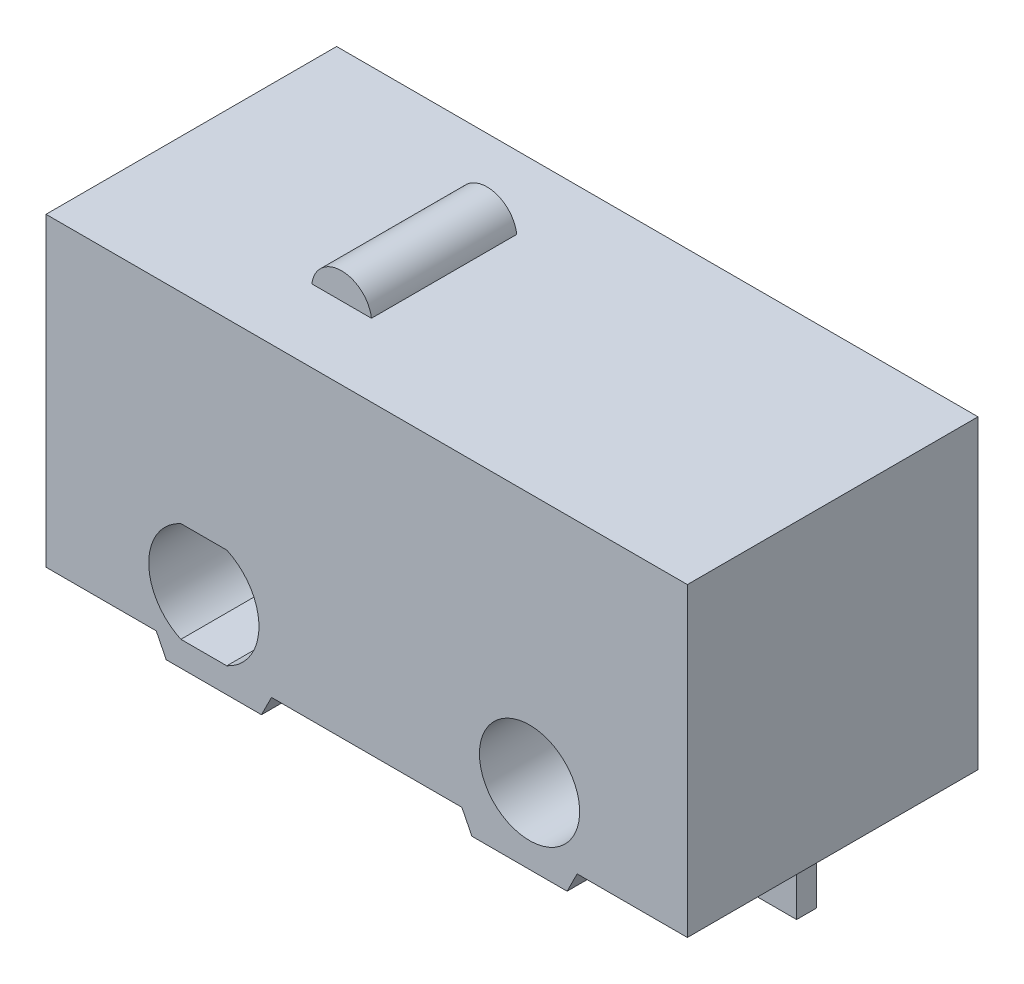
ISO-10303-21;
HEADER;
FILE_DESCRIPTION(('STEP AP214'),'2;1');
FILE_NAME('part.step','',(''),(''),'','','');
FILE_SCHEMA(('AUTOMOTIVE_DESIGN { 1 0 10303 214 1 1 1 1 }'));
ENDSEC;
DATA;
#1=APPLICATION_CONTEXT('core data for automotive mechanical design processes');
#2=APPLICATION_PROTOCOL_DEFINITION('international standard','automotive_design',2000,#1);
#3=PRODUCT_CONTEXT('',#1,'mechanical');
#4=PRODUCT('Part','Part','',(#3));
#5=PRODUCT_RELATED_PRODUCT_CATEGORY('part','',(#4));
#6=PRODUCT_DEFINITION_FORMATION('','',#4);
#7=PRODUCT_DEFINITION_CONTEXT('part definition',#1,'design');
#8=PRODUCT_DEFINITION('design','',#6,#7);
#9=PRODUCT_DEFINITION_SHAPE('','',#8);
#10=(LENGTH_UNIT() NAMED_UNIT(*) SI_UNIT(.MILLI.,.METRE.));
#11=(NAMED_UNIT(*) PLANE_ANGLE_UNIT() SI_UNIT($,.RADIAN.));
#12=(NAMED_UNIT(*) SI_UNIT($,.STERADIAN.) SOLID_ANGLE_UNIT());
#13=UNCERTAINTY_MEASURE_WITH_UNIT(LENGTH_MEASURE(1.E-05),#10,'distance_accuracy_value','');
#14=(GEOMETRIC_REPRESENTATION_CONTEXT(3) GLOBAL_UNCERTAINTY_ASSIGNED_CONTEXT((#13)) GLOBAL_UNIT_ASSIGNED_CONTEXT((#10,
#11,#12)) REPRESENTATION_CONTEXT('',''));
#15=CARTESIAN_POINT('',(0.,0.,0.));
#16=DIRECTION('',(0.,0.,1.));
#17=DIRECTION('',(1.,0.,0.));
#18=AXIS2_PLACEMENT_3D('',#15,#16,#17);
#19=CARTESIAN_POINT('',(-9.65,-1.5,2.9));
#20=DIRECTION('',(0.,1.,0.));
#21=DIRECTION('',(-1.,0.,0.));
#22=AXIS2_PLACEMENT_3D('',#19,#20,#21);
#23=PLANE('',#22);
#24=DIRECTION('',(1.,0.,0.));
#25=VECTOR('',#24,1.);
#26=CARTESIAN_POINT('',(-9.65,-1.5,-2.9));
#27=LINE('',#26,#25);
#28=CARTESIAN_POINT('',(-1.15,-1.5,-2.9));
#29=VERTEX_POINT('',#28);
#30=CARTESIAN_POINT('',(0.75,-1.5,-2.9));
#31=VERTEX_POINT('',#30);
#32=EDGE_CURVE('E440',#29,#31,#27,.T.);
#33=ORIENTED_EDGE('',*,*,#32,.T.);
#34=DIRECTION('',(0.,0.,1.));
#35=VECTOR('',#34,1.);
#36=CARTESIAN_POINT('',(0.75,-1.5,-2.9));
#37=LINE('',#36,#35);
#38=CARTESIAN_POINT('',(0.75,-1.5,2.90000000006785));
#39=VERTEX_POINT('',#38);
#40=EDGE_CURVE('E335',#31,#39,#37,.T.);
#41=ORIENTED_EDGE('',*,*,#40,.T.);
#42=DIRECTION('',(1.,0.,0.));
#43=VECTOR('',#42,1.);
#44=CARTESIAN_POINT('',(-9.65,-1.5,2.9));
#45=LINE('',#44,#43);
#46=CARTESIAN_POINT('',(-1.15,-1.5,2.90000000006785));
#47=VERTEX_POINT('',#46);
#48=EDGE_CURVE('E450',#47,#39,#45,.T.);
#49=ORIENTED_EDGE('',*,*,#48,.F.);
#50=DIRECTION('',(0.,0.,1.));
#51=VECTOR('',#50,1.);
#52=CARTESIAN_POINT('',(-1.15,-1.5,-2.9));
#53=LINE('',#52,#51);
#54=EDGE_CURVE('E375',#29,#47,#53,.T.);
#55=ORIENTED_EDGE('',*,*,#54,.F.);
#56=EDGE_LOOP('',(#33,#41,#49,#55));
#57=FACE_BOUND('',#56,.T.);
#58=ADVANCED_FACE('F16',(#57),#23,.F.);
#59=CARTESIAN_POINT('',(-9.65,5.,2.9));
#60=DIRECTION('',(0.,-1.,0.));
#61=DIRECTION('',(0.,0.,-1.));
#62=AXIS2_PLACEMENT_3D('',#59,#60,#61);
#63=PLANE('',#62);
#64=DIRECTION('',(-1.,0.,0.));
#65=VECTOR('',#64,1.);
#66=CARTESIAN_POINT('',(-9.65,5.,-2.9));
#67=LINE('',#66,#65);
#68=CARTESIAN_POINT('',(3.15,5.,-2.9));
#69=VERTEX_POINT('',#68);
#70=CARTESIAN_POINT('',(-9.65,5.,-2.9));
#71=VERTEX_POINT('',#70);
#72=EDGE_CURVE('E445',#69,#71,#67,.T.);
#73=ORIENTED_EDGE('',*,*,#72,.T.);
#74=DIRECTION('',(0.,0.,-1.));
#75=VECTOR('',#74,1.);
#76=CARTESIAN_POINT('',(-9.65,5.,2.9));
#77=LINE('',#76,#75);
#78=CARTESIAN_POINT('',(-9.65,5.,2.9));
#79=VERTEX_POINT('',#78);
#80=EDGE_CURVE('E25',#79,#71,#77,.T.);
#81=ORIENTED_EDGE('',*,*,#80,.F.);
#82=DIRECTION('',(-1.,0.,0.));
#83=VECTOR('',#82,1.);
#84=CARTESIAN_POINT('',(-9.65,5.,2.9));
#85=LINE('',#84,#83);
#86=CARTESIAN_POINT('',(3.15,5.,2.9));
#87=VERTEX_POINT('',#86);
#88=EDGE_CURVE('E455',#87,#79,#85,.T.);
#89=ORIENTED_EDGE('',*,*,#88,.F.);
#90=DIRECTION('',(0.,0.,-1.));
#91=VECTOR('',#90,1.);
#92=CARTESIAN_POINT('',(3.15,5.,2.9));
#93=LINE('',#92,#91);
#94=EDGE_CURVE('E11',#87,#69,#93,.T.);
#95=ORIENTED_EDGE('',*,*,#94,.T.);
#96=EDGE_LOOP('',(#73,#81,#89,#95));
#97=FACE_BOUND('',#96,.T.);
#98=DIRECTION('',(1.,0.,0.));
#99=VECTOR('',#98,1.);
#100=CARTESIAN_POINT('',(-5.79516451722003,5.,1.45));
#101=LINE('',#100,#99);
#102=CARTESIAN_POINT('',(-5.79516451722003,5.,1.45));
#103=VERTEX_POINT('',#102);
#104=CARTESIAN_POINT('',(-4.60483548277998,5.,1.45));
#105=VERTEX_POINT('',#104);
#106=EDGE_CURVE('E391',#103,#105,#101,.T.);
#107=ORIENTED_EDGE('',*,*,#106,.F.);
#108=DIRECTION('',(0.,0.,-1.));
#109=VECTOR('',#108,1.);
#110=CARTESIAN_POINT('',(-5.79516451722003,5.,1.45));
#111=LINE('',#110,#109);
#112=CARTESIAN_POINT('',(-5.79516451722003,5.,-1.45));
#113=VERTEX_POINT('',#112);
#114=EDGE_CURVE('E396',#103,#113,#111,.T.);
#115=ORIENTED_EDGE('',*,*,#114,.T.);
#116=DIRECTION('',(1.,0.,0.));
#117=VECTOR('',#116,1.);
#118=CARTESIAN_POINT('',(-5.79516451722003,5.,-1.45));
#119=LINE('',#118,#117);
#120=CARTESIAN_POINT('',(-4.60483548277998,5.,-1.45));
#121=VERTEX_POINT('',#120);
#122=EDGE_CURVE('E386',#113,#121,#119,.T.);
#123=ORIENTED_EDGE('',*,*,#122,.T.);
#124=DIRECTION('',(0.,0.,-1.));
#125=VECTOR('',#124,1.);
#126=CARTESIAN_POINT('',(-4.60483548277998,5.,1.45));
#127=LINE('',#126,#125);
#128=EDGE_CURVE('E393',#105,#121,#127,.T.);
#129=ORIENTED_EDGE('',*,*,#128,.F.);
#130=EDGE_LOOP('',(#107,#115,#123,#129));
#131=FACE_BOUND('',#130,.T.);
#132=ADVANCED_FACE('F519',(#97,#131),#63,.F.);
#133=CARTESIAN_POINT('',(-9.65,5.,2.9));
#134=DIRECTION('',(1.,0.,0.));
#135=DIRECTION('',(0.,0.,-1.));
#136=AXIS2_PLACEMENT_3D('',#133,#134,#135);
#137=PLANE('',#136);
#138=DIRECTION('',(0.,-1.,0.));
#139=VECTOR('',#138,1.);
#140=CARTESIAN_POINT('',(-9.65,5.,-2.9));
#141=LINE('',#140,#139);
#142=CARTESIAN_POINT('',(-9.65,-1.1,-2.9));
#143=VERTEX_POINT('',#142);
#144=EDGE_CURVE('E437',#71,#143,#141,.T.);
#145=ORIENTED_EDGE('',*,*,#144,.T.);
#146=DIRECTION('',(0.,0.,1.));
#147=VECTOR('',#146,1.);
#148=CARTESIAN_POINT('',(-9.65,-1.1,-2.9));
#149=LINE('',#148,#147);
#150=CARTESIAN_POINT('',(-9.65,-1.1,2.90000000006785));
#151=VERTEX_POINT('',#150);
#152=EDGE_CURVE('E350',#143,#151,#149,.T.);
#153=ORIENTED_EDGE('',*,*,#152,.T.);
#154=DIRECTION('',(0.,-1.,0.));
#155=VECTOR('',#154,1.);
#156=CARTESIAN_POINT('',(-9.65,5.,2.9));
#157=LINE('',#156,#155);
#158=EDGE_CURVE('E447',#79,#151,#157,.T.);
#159=ORIENTED_EDGE('',*,*,#158,.F.);
#160=ORIENTED_EDGE('',*,*,#80,.T.);
#161=EDGE_LOOP('',(#145,#153,#159,#160));
#162=FACE_BOUND('',#161,.T.);
#163=ADVANCED_FACE('F18',(#162),#137,.F.);
#164=CARTESIAN_POINT('',(-7.25,-1.5,2.90000000006785));
#165=VERTEX_POINT('',#164);
#166=CARTESIAN_POINT('',(-5.35,-1.5,2.90000000006785));
#167=VERTEX_POINT('',#166);
#168=EDGE_CURVE('E451',#165,#167,#45,.T.);
#169=ORIENTED_EDGE('',*,*,#168,.F.);
#170=DIRECTION('',(0.,0.,1.));
#171=VECTOR('',#170,1.);
#172=CARTESIAN_POINT('',(-7.25,-1.5,-2.9));
#173=LINE('',#172,#171);
#174=CARTESIAN_POINT('',(-7.25,-1.5,-2.9));
#175=VERTEX_POINT('',#174);
#176=EDGE_CURVE('E349',#175,#165,#173,.T.);
#177=ORIENTED_EDGE('',*,*,#176,.F.);
#178=CARTESIAN_POINT('',(-5.35,-1.5,-2.9));
#179=VERTEX_POINT('',#178);
#180=EDGE_CURVE('E441',#175,#179,#27,.T.);
#181=ORIENTED_EDGE('',*,*,#180,.T.);
#182=DIRECTION('',(0.,0.,1.));
#183=VECTOR('',#182,1.);
#184=CARTESIAN_POINT('',(-5.35,-1.5,-2.9));
#185=LINE('',#184,#183);
#186=EDGE_CURVE('E378',#179,#167,#185,.T.);
#187=ORIENTED_EDGE('',*,*,#186,.T.);
#188=EDGE_LOOP('',(#169,#177,#181,#187));
#189=FACE_BOUND('',#188,.T.);
#190=ADVANCED_FACE('F532',(#189),#23,.F.);
#191=CARTESIAN_POINT('',(3.15,5.,2.9));
#192=DIRECTION('',(-1.,0.,0.));
#193=DIRECTION('',(0.,0.,1.));
#194=AXIS2_PLACEMENT_3D('',#191,#192,#193);
#195=PLANE('',#194);
#196=DIRECTION('',(0.,1.,0.));
#197=VECTOR('',#196,1.);
#198=CARTESIAN_POINT('',(3.15,5.,2.9));
#199=LINE('',#198,#197);
#200=CARTESIAN_POINT('',(3.15,-1.1,2.90000000006785));
#201=VERTEX_POINT('',#200);
#202=EDGE_CURVE('E453',#201,#87,#199,.T.);
#203=ORIENTED_EDGE('',*,*,#202,.F.);
#204=DIRECTION('',(0.,0.,1.));
#205=VECTOR('',#204,1.);
#206=CARTESIAN_POINT('',(3.15,-1.1,-2.9));
#207=LINE('',#206,#205);
#208=CARTESIAN_POINT('',(3.15,-1.1,-2.9));
#209=VERTEX_POINT('',#208);
#210=EDGE_CURVE('E332',#209,#201,#207,.T.);
#211=ORIENTED_EDGE('',*,*,#210,.F.);
#212=DIRECTION('',(0.,1.,0.));
#213=VECTOR('',#212,1.);
#214=CARTESIAN_POINT('',(3.15,5.,-2.9));
#215=LINE('',#214,#213);
#216=EDGE_CURVE('E443',#209,#69,#215,.T.);
#217=ORIENTED_EDGE('',*,*,#216,.T.);
#218=ORIENTED_EDGE('',*,*,#94,.F.);
#219=EDGE_LOOP('',(#203,#211,#217,#218));
#220=FACE_BOUND('',#219,.T.);
#221=ADVANCED_FACE('F512',(#220),#195,.F.);
#222=CARTESIAN_POINT('',(-9.65,5.,2.9));
#223=DIRECTION('',(0.,0.,1.));
#224=DIRECTION('',(1.,0.,0.));
#225=AXIS2_PLACEMENT_3D('',#222,#223,#224);
#226=PLANE('',#225);
#227=DIRECTION('',(-1.,0.,0.));
#228=VECTOR('',#227,1.);
#229=CARTESIAN_POINT('',(0.95,-1.1,2.90000000006785));
#230=LINE('',#229,#228);
#231=CARTESIAN_POINT('',(0.95,-1.1,2.90000000006785));
#232=VERTEX_POINT('',#231);
#233=EDGE_CURVE('E320',#201,#232,#230,.T.);
#234=ORIENTED_EDGE('',*,*,#233,.F.);
#235=ORIENTED_EDGE('',*,*,#202,.T.);
#236=ORIENTED_EDGE('',*,*,#88,.T.);
#237=ORIENTED_EDGE('',*,*,#158,.T.);
#238=DIRECTION('',(-1.,0.,0.));
#239=VECTOR('',#238,1.);
#240=CARTESIAN_POINT('',(-9.65,-1.1,2.90000000006785));
#241=LINE('',#240,#239);
#242=CARTESIAN_POINT('',(-7.45,-1.1,2.90000000006785));
#243=VERTEX_POINT('',#242);
#244=EDGE_CURVE('E341',#243,#151,#241,.T.);
#245=ORIENTED_EDGE('',*,*,#244,.F.);
#246=DIRECTION('',(-0.44721359549996,0.894427190999915,0.));
#247=VECTOR('',#246,1.);
#248=CARTESIAN_POINT('',(-7.45,-1.1,2.90000000006785));
#249=LINE('',#248,#247);
#250=EDGE_CURVE('E334',#165,#243,#249,.T.);
#251=ORIENTED_EDGE('',*,*,#250,.F.);
#252=ORIENTED_EDGE('',*,*,#168,.T.);
#253=DIRECTION('',(-0.447213595499955,-0.894427190999917,0.));
#254=VECTOR('',#253,1.);
#255=CARTESIAN_POINT('',(-5.35,-1.5,2.90000000006785));
#256=LINE('',#255,#254);
#257=CARTESIAN_POINT('',(-5.15,-1.1,2.90000000006785));
#258=VERTEX_POINT('',#257);
#259=EDGE_CURVE('E362',#258,#167,#256,.T.);
#260=ORIENTED_EDGE('',*,*,#259,.F.);
#261=DIRECTION('',(-1.,0.,0.));
#262=VECTOR('',#261,1.);
#263=CARTESIAN_POINT('',(-5.15,-1.1,2.90000000006785));
#264=LINE('',#263,#262);
#265=CARTESIAN_POINT('',(-1.35,-1.1,2.90000000006785));
#266=VERTEX_POINT('',#265);
#267=EDGE_CURVE('E359',#266,#258,#264,.T.);
#268=ORIENTED_EDGE('',*,*,#267,.F.);
#269=DIRECTION('',(-0.447213595499956,0.894427190999917,0.));
#270=VECTOR('',#269,1.);
#271=CARTESIAN_POINT('',(-1.35,-1.1,2.90000000006785));
#272=LINE('',#271,#270);
#273=EDGE_CURVE('E353',#47,#266,#272,.T.);
#274=ORIENTED_EDGE('',*,*,#273,.F.);
#275=ORIENTED_EDGE('',*,*,#48,.T.);
#276=DIRECTION('',(-0.447213595499956,-0.894427190999917,0.));
#277=VECTOR('',#276,1.);
#278=CARTESIAN_POINT('',(0.95,-1.1,2.90000000006785));
#279=LINE('',#278,#277);
#280=EDGE_CURVE('E323',#232,#39,#279,.T.);
#281=ORIENTED_EDGE('',*,*,#280,.F.);
#282=EDGE_LOOP('',(#234,#235,#236,#237,#245,#251,#252,#260,#268,#274,#275,#281));
#283=FACE_BOUND('',#282,.T.);
#284=CARTESIAN_POINT('',(-6.5,0.,2.9));
#285=DIRECTION('',(0.,0.,-1.));
#286=DIRECTION('',(-1.,0.,0.));
#287=AXIS2_PLACEMENT_3D('',#284,#285,#286);
#288=CIRCLE('',#287,1.1);
#289=CARTESIAN_POINT('',(-6.04174243050442,1.,2.9));
#290=VERTEX_POINT('',#289);
#291=CARTESIAN_POINT('',(-6.04174243050442,-1.,2.9));
#292=VERTEX_POINT('',#291);
#293=EDGE_CURVE('E410',#290,#292,#288,.T.);
#294=ORIENTED_EDGE('',*,*,#293,.T.);
#295=DIRECTION('',(-1.,0.,0.));
#296=VECTOR('',#295,1.);
#297=CARTESIAN_POINT('',(-6.04174243050442,-1.,2.9));
#298=LINE('',#297,#296);
#299=CARTESIAN_POINT('',(-6.95825756949558,-1.,2.9));
#300=VERTEX_POINT('',#299);
#301=EDGE_CURVE('E413',#292,#300,#298,.T.);
#302=ORIENTED_EDGE('',*,*,#301,.T.);
#303=CARTESIAN_POINT('',(-6.5,0.,2.9));
#304=DIRECTION('',(0.,0.,-1.));
#305=DIRECTION('',(-1.,0.,0.));
#306=AXIS2_PLACEMENT_3D('',#303,#304,#305);
#307=CIRCLE('',#306,1.1);
#308=CARTESIAN_POINT('',(-6.95825756949558,1.,2.9));
#309=VERTEX_POINT('',#308);
#310=EDGE_CURVE('E416',#300,#309,#307,.T.);
#311=ORIENTED_EDGE('',*,*,#310,.T.);
#312=DIRECTION('',(1.,0.,0.));
#313=VECTOR('',#312,1.);
#314=CARTESIAN_POINT('',(-6.04174243050442,1.,2.9));
#315=LINE('',#314,#313);
#316=EDGE_CURVE('E419',#309,#290,#315,.T.);
#317=ORIENTED_EDGE('',*,*,#316,.T.);
#318=EDGE_LOOP('',(#294,#302,#311,#317));
#319=FACE_BOUND('',#318,.T.);
#320=CARTESIAN_POINT('',(0.,0.,2.9));
#321=DIRECTION('',(0.,0.,-1.));
#322=DIRECTION('',(-1.,0.,0.));
#323=AXIS2_PLACEMENT_3D('',#320,#321,#322);
#324=CIRCLE('',#323,1.);
#325=CARTESIAN_POINT('',(-1.,0.,2.9));
#326=VERTEX_POINT('',#325);
#327=EDGE_CURVE('E434',#326,#326,#324,.T.);
#328=ORIENTED_EDGE('',*,*,#327,.T.);
#329=EDGE_LOOP('',(#328));
#330=FACE_BOUND('',#329,.T.);
#331=ADVANCED_FACE('F497',(#283,#319,#330),#226,.T.);
#332=CARTESIAN_POINT('',(-9.65,5.,-2.9));
#333=DIRECTION('',(0.,0.,1.));
#334=DIRECTION('',(1.,0.,0.));
#335=AXIS2_PLACEMENT_3D('',#332,#333,#334);
#336=PLANE('',#335);
#337=ORIENTED_EDGE('',*,*,#216,.F.);
#338=DIRECTION('',(-1.,0.,0.));
#339=VECTOR('',#338,1.);
#340=CARTESIAN_POINT('',(0.95,-1.1,-2.9));
#341=LINE('',#340,#339);
#342=CARTESIAN_POINT('',(0.95,-1.1,-2.9));
#343=VERTEX_POINT('',#342);
#344=EDGE_CURVE('E325',#209,#343,#341,.T.);
#345=ORIENTED_EDGE('',*,*,#344,.T.);
#346=DIRECTION('',(-0.447213595499956,-0.894427190999917,0.));
#347=VECTOR('',#346,1.);
#348=CARTESIAN_POINT('',(0.95,-1.1,-2.9));
#349=LINE('',#348,#347);
#350=EDGE_CURVE('E328',#343,#31,#349,.T.);
#351=ORIENTED_EDGE('',*,*,#350,.T.);
#352=ORIENTED_EDGE('',*,*,#32,.F.);
#353=DIRECTION('',(-0.447213595499956,0.894427190999917,0.));
#354=VECTOR('',#353,1.);
#355=CARTESIAN_POINT('',(-1.35,-1.1,-2.9));
#356=LINE('',#355,#354);
#357=CARTESIAN_POINT('',(-1.35,-1.1,-2.9));
#358=VERTEX_POINT('',#357);
#359=EDGE_CURVE('E365',#29,#358,#356,.T.);
#360=ORIENTED_EDGE('',*,*,#359,.T.);
#361=DIRECTION('',(-1.,0.,0.));
#362=VECTOR('',#361,1.);
#363=CARTESIAN_POINT('',(-5.15,-1.1,-2.9));
#364=LINE('',#363,#362);
#365=CARTESIAN_POINT('',(-5.15,-1.1,-2.9));
#366=VERTEX_POINT('',#365);
#367=EDGE_CURVE('E368',#358,#366,#364,.T.);
#368=ORIENTED_EDGE('',*,*,#367,.T.);
#369=DIRECTION('',(-0.447213595499955,-0.894427190999917,0.));
#370=VECTOR('',#369,1.);
#371=CARTESIAN_POINT('',(-5.35,-1.5,-2.9));
#372=LINE('',#371,#370);
#373=EDGE_CURVE('E371',#366,#179,#372,.T.);
#374=ORIENTED_EDGE('',*,*,#373,.T.);
#375=ORIENTED_EDGE('',*,*,#180,.F.);
#376=DIRECTION('',(-0.44721359549996,0.894427190999915,0.));
#377=VECTOR('',#376,1.);
#378=CARTESIAN_POINT('',(-7.45,-1.1,-2.9));
#379=LINE('',#378,#377);
#380=CARTESIAN_POINT('',(-7.45,-1.1,-2.9));
#381=VERTEX_POINT('',#380);
#382=EDGE_CURVE('E343',#175,#381,#379,.T.);
#383=ORIENTED_EDGE('',*,*,#382,.T.);
#384=DIRECTION('',(-1.,0.,0.));
#385=VECTOR('',#384,1.);
#386=CARTESIAN_POINT('',(-9.65,-1.1,-2.9));
#387=LINE('',#386,#385);
#388=EDGE_CURVE('E346',#381,#143,#387,.T.);
#389=ORIENTED_EDGE('',*,*,#388,.T.);
#390=ORIENTED_EDGE('',*,*,#144,.F.);
#391=ORIENTED_EDGE('',*,*,#72,.F.);
#392=EDGE_LOOP('',(#337,#345,#351,#352,#360,#368,#374,#375,#383,#389,#390,#391));
#393=FACE_BOUND('',#392,.T.);
#394=DIRECTION('',(-1.,0.,0.));
#395=VECTOR('',#394,1.);
#396=CARTESIAN_POINT('',(-6.04174243050442,-1.,-2.9));
#397=LINE('',#396,#395);
#398=CARTESIAN_POINT('',(-6.04174243050442,-1.,-2.9));
#399=VERTEX_POINT('',#398);
#400=CARTESIAN_POINT('',(-6.95825756949558,-1.,-2.9));
#401=VERTEX_POINT('',#400);
#402=EDGE_CURVE('E401',#399,#401,#397,.T.);
#403=ORIENTED_EDGE('',*,*,#402,.F.);
#404=CARTESIAN_POINT('',(-6.5,0.,-2.9));
#405=DIRECTION('',(0.,0.,-1.));
#406=DIRECTION('',(-1.,0.,0.));
#407=AXIS2_PLACEMENT_3D('',#404,#405,#406);
#408=CIRCLE('',#407,1.1);
#409=CARTESIAN_POINT('',(-6.04174243050442,1.,-2.9));
#410=VERTEX_POINT('',#409);
#411=EDGE_CURVE('E399',#410,#399,#408,.T.);
#412=ORIENTED_EDGE('',*,*,#411,.F.);
#413=DIRECTION('',(1.,0.,0.));
#414=VECTOR('',#413,1.);
#415=CARTESIAN_POINT('',(-6.04174243050442,1.,-2.9));
#416=LINE('',#415,#414);
#417=CARTESIAN_POINT('',(-6.95825756949558,1.,-2.9));
#418=VERTEX_POINT('',#417);
#419=EDGE_CURVE('E407',#418,#410,#416,.T.);
#420=ORIENTED_EDGE('',*,*,#419,.F.);
#421=CARTESIAN_POINT('',(-6.5,0.,-2.9));
#422=DIRECTION('',(0.,0.,-1.));
#423=DIRECTION('',(-1.,0.,0.));
#424=AXIS2_PLACEMENT_3D('',#421,#422,#423);
#425=CIRCLE('',#424,1.1);
#426=EDGE_CURVE('E404',#401,#418,#425,.T.);
#427=ORIENTED_EDGE('',*,*,#426,.F.);
#428=EDGE_LOOP('',(#403,#412,#420,#427));
#429=FACE_BOUND('',#428,.T.);
#430=CARTESIAN_POINT('',(0.,0.,-2.9));
#431=DIRECTION('',(0.,0.,-1.));
#432=DIRECTION('',(-1.,0.,0.));
#433=AXIS2_PLACEMENT_3D('',#430,#431,#432);
#434=CIRCLE('',#433,1.);
#435=CARTESIAN_POINT('',(-1.,0.,-2.9));
#436=VERTEX_POINT('',#435);
#437=EDGE_CURVE('E425',#436,#436,#434,.T.);
#438=ORIENTED_EDGE('',*,*,#437,.F.);
#439=EDGE_LOOP('',(#438));
#440=FACE_BOUND('',#439,.T.);
#441=ADVANCED_FACE('F508',(#393,#429,#440),#336,.F.);
#442=CARTESIAN_POINT('',(0.,0.,2.9));
#443=DIRECTION('',(0.,0.,-1.));
#444=DIRECTION('',(-1.,0.,0.));
#445=AXIS2_PLACEMENT_3D('',#442,#443,#444);
#446=CYLINDRICAL_SURFACE('',#445,1.);
#447=ORIENTED_EDGE('',*,*,#327,.F.);
#448=EDGE_LOOP('',(#447));
#449=FACE_BOUND('',#448,.T.);
#450=ORIENTED_EDGE('',*,*,#437,.T.);
#451=EDGE_LOOP('',(#450));
#452=FACE_BOUND('',#451,.T.);
#453=ADVANCED_FACE('F900',(#449,#452),#446,.F.);
#454=CARTESIAN_POINT('',(-6.5,0.,2.9));
#455=DIRECTION('',(0.,0.,-1.));
#456=DIRECTION('',(-1.,0.,0.));
#457=AXIS2_PLACEMENT_3D('',#454,#455,#456);
#458=CYLINDRICAL_SURFACE('',#457,1.1);
#459=ORIENTED_EDGE('',*,*,#411,.T.);
#460=DIRECTION('',(0.,0.,-1.));
#461=VECTOR('',#460,1.);
#462=CARTESIAN_POINT('',(-6.04174243050442,-1.,2.9));
#463=LINE('',#462,#461);
#464=EDGE_CURVE('E422',#292,#399,#463,.T.);
#465=ORIENTED_EDGE('',*,*,#464,.F.);
#466=ORIENTED_EDGE('',*,*,#293,.F.);
#467=DIRECTION('',(0.,0.,-1.));
#468=VECTOR('',#467,1.);
#469=CARTESIAN_POINT('',(-6.04174243050442,1.,2.9));
#470=LINE('',#469,#468);
#471=EDGE_CURVE('E423',#290,#410,#470,.T.);
#472=ORIENTED_EDGE('',*,*,#471,.T.);
#473=EDGE_LOOP('',(#459,#465,#466,#472));
#474=FACE_BOUND('',#473,.T.);
#475=ADVANCED_FACE('F889',(#474),#458,.F.);
#476=CARTESIAN_POINT('',(-6.04174243050442,1.,2.9));
#477=DIRECTION('',(0.,1.,0.));
#478=DIRECTION('',(0.,0.,1.));
#479=AXIS2_PLACEMENT_3D('',#476,#477,#478);
#480=PLANE('',#479);
#481=ORIENTED_EDGE('',*,*,#419,.T.);
#482=ORIENTED_EDGE('',*,*,#471,.F.);
#483=ORIENTED_EDGE('',*,*,#316,.F.);
#484=DIRECTION('',(0.,0.,-1.));
#485=VECTOR('',#484,1.);
#486=CARTESIAN_POINT('',(-6.95825756949558,1.,2.9));
#487=LINE('',#486,#485);
#488=EDGE_CURVE('E426',#309,#418,#487,.T.);
#489=ORIENTED_EDGE('',*,*,#488,.T.);
#490=EDGE_LOOP('',(#481,#482,#483,#489));
#491=FACE_BOUND('',#490,.T.);
#492=ADVANCED_FACE('F878',(#491),#480,.F.);
#493=CARTESIAN_POINT('',(-6.5,0.,2.9));
#494=DIRECTION('',(0.,0.,-1.));
#495=DIRECTION('',(-1.,0.,0.));
#496=AXIS2_PLACEMENT_3D('',#493,#494,#495);
#497=CYLINDRICAL_SURFACE('',#496,1.1);
#498=ORIENTED_EDGE('',*,*,#426,.T.);
#499=ORIENTED_EDGE('',*,*,#488,.F.);
#500=ORIENTED_EDGE('',*,*,#310,.F.);
#501=DIRECTION('',(0.,0.,-1.));
#502=VECTOR('',#501,1.);
#503=CARTESIAN_POINT('',(-6.95825756949558,-1.,2.9));
#504=LINE('',#503,#502);
#505=EDGE_CURVE('E428',#300,#401,#504,.T.);
#506=ORIENTED_EDGE('',*,*,#505,.T.);
#507=EDGE_LOOP('',(#498,#499,#500,#506));
#508=FACE_BOUND('',#507,.T.);
#509=ADVANCED_FACE('F867',(#508),#497,.F.);
#510=CARTESIAN_POINT('',(-6.04174243050442,-1.,2.9));
#511=DIRECTION('',(0.,-1.,0.));
#512=DIRECTION('',(1.,0.,0.));
#513=AXIS2_PLACEMENT_3D('',#510,#511,#512);
#514=PLANE('',#513);
#515=ORIENTED_EDGE('',*,*,#402,.T.);
#516=ORIENTED_EDGE('',*,*,#505,.F.);
#517=ORIENTED_EDGE('',*,*,#301,.F.);
#518=ORIENTED_EDGE('',*,*,#464,.T.);
#519=EDGE_LOOP('',(#515,#516,#517,#518));
#520=FACE_BOUND('',#519,.T.);
#521=ADVANCED_FACE('F857',(#520),#514,.F.);
#522=CARTESIAN_POINT('',(-5.2,4.9239789671061,1.45));
#523=DIRECTION('',(0.,0.,-1.));
#524=DIRECTION('',(-1.,0.,0.));
#525=AXIS2_PLACEMENT_3D('',#522,#523,#524);
#526=CYLINDRICAL_SURFACE('',#525,0.6);
#527=CARTESIAN_POINT('',(-5.2,4.9239789671061,-1.45));
#528=DIRECTION('',(0.,0.,1.));
#529=DIRECTION('',(-1.,0.,0.));
#530=AXIS2_PLACEMENT_3D('',#527,#528,#529);
#531=CIRCLE('',#530,0.6);
#532=EDGE_CURVE('E377',#121,#113,#531,.T.);
#533=ORIENTED_EDGE('',*,*,#532,.T.);
#534=ORIENTED_EDGE('',*,*,#114,.F.);
#535=CARTESIAN_POINT('',(-5.2,4.9239789671061,1.45));
#536=DIRECTION('',(0.,0.,1.));
#537=DIRECTION('',(-1.,0.,0.));
#538=AXIS2_PLACEMENT_3D('',#535,#536,#537);
#539=CIRCLE('',#538,0.6);
#540=EDGE_CURVE('E389',#105,#103,#539,.T.);
#541=ORIENTED_EDGE('',*,*,#540,.F.);
#542=ORIENTED_EDGE('',*,*,#128,.T.);
#543=EDGE_LOOP('',(#533,#534,#541,#542));
#544=FACE_BOUND('',#543,.T.);
#545=ADVANCED_FACE('F847',(#544),#526,.T.);
#546=CARTESIAN_POINT('',(-5.2,4.9239789671061,1.45));
#547=DIRECTION('',(0.,0.,-1.));
#548=DIRECTION('',(-1.,0.,0.));
#549=AXIS2_PLACEMENT_3D('',#546,#547,#548);
#550=PLANE('',#549);
#551=ORIENTED_EDGE('',*,*,#540,.T.);
#552=ORIENTED_EDGE('',*,*,#106,.T.);
#553=EDGE_LOOP('',(#551,#552));
#554=FACE_BOUND('',#553,.T.);
#555=ADVANCED_FACE('F553',(#554),#550,.F.);
#556=CARTESIAN_POINT('',(-5.2,4.9239789671061,-1.45));
#557=DIRECTION('',(0.,0.,-1.));
#558=DIRECTION('',(-1.,0.,0.));
#559=AXIS2_PLACEMENT_3D('',#556,#557,#558);
#560=PLANE('',#559);
#561=ORIENTED_EDGE('',*,*,#532,.F.);
#562=ORIENTED_EDGE('',*,*,#122,.F.);
#563=EDGE_LOOP('',(#561,#562));
#564=FACE_BOUND('',#563,.T.);
#565=ADVANCED_FACE('F545',(#564),#560,.T.);
#566=CARTESIAN_POINT('',(-1.35,-1.1,-2.9));
#567=DIRECTION('',(0.894427190999917,0.447213595499956,0.));
#568=DIRECTION('',(-0.447213595499956,0.894427190999917,0.));
#569=AXIS2_PLACEMENT_3D('',#566,#567,#568);
#570=PLANE('',#569);
#571=ORIENTED_EDGE('',*,*,#273,.T.);
#572=DIRECTION('',(0.,0.,1.));
#573=VECTOR('',#572,1.);
#574=CARTESIAN_POINT('',(-1.35,-1.1,-2.9));
#575=LINE('',#574,#573);
#576=EDGE_CURVE('E374',#358,#266,#575,.T.);
#577=ORIENTED_EDGE('',*,*,#576,.F.);
#578=ORIENTED_EDGE('',*,*,#359,.F.);
#579=ORIENTED_EDGE('',*,*,#54,.T.);
#580=EDGE_LOOP('',(#571,#577,#578,#579));
#581=FACE_BOUND('',#580,.T.);
#582=ADVANCED_FACE('F543',(#581),#570,.F.);
#583=CARTESIAN_POINT('',(-5.35,-1.5,-2.9));
#584=DIRECTION('',(-0.894427190999917,0.447213595499955,0.));
#585=DIRECTION('',(-0.447213595499955,-0.894427190999917,0.));
#586=AXIS2_PLACEMENT_3D('',#583,#584,#585);
#587=PLANE('',#586);
#588=ORIENTED_EDGE('',*,*,#259,.T.);
#589=ORIENTED_EDGE('',*,*,#186,.F.);
#590=ORIENTED_EDGE('',*,*,#373,.F.);
#591=DIRECTION('',(0.,0.,1.));
#592=VECTOR('',#591,1.);
#593=CARTESIAN_POINT('',(-5.15,-1.1,-2.9));
#594=LINE('',#593,#592);
#595=EDGE_CURVE('E381',#366,#258,#594,.T.);
#596=ORIENTED_EDGE('',*,*,#595,.T.);
#597=EDGE_LOOP('',(#588,#589,#590,#596));
#598=FACE_BOUND('',#597,.T.);
#599=ADVANCED_FACE('F537',(#598),#587,.F.);
#600=CARTESIAN_POINT('',(-5.15,-1.1,-2.9));
#601=DIRECTION('',(0.,1.,0.));
#602=DIRECTION('',(-1.,0.,0.));
#603=AXIS2_PLACEMENT_3D('',#600,#601,#602);
#604=PLANE('',#603);
#605=DIRECTION('',(0.,0.,-1.));
#606=VECTOR('',#605,1.);
#607=CARTESIAN_POINT('',(-4.05,-1.1,0.2));
#608=LINE('',#607,#606);
#609=CARTESIAN_POINT('',(-4.05,-1.1,0.2));
#610=VERTEX_POINT('',#609);
#611=CARTESIAN_POINT('',(-4.05,-1.1,-0.2));
#612=VERTEX_POINT('',#611);
#613=EDGE_CURVE('E277',#610,#612,#608,.T.);
#614=ORIENTED_EDGE('',*,*,#613,.F.);
#615=DIRECTION('',(-1.,0.,0.));
#616=VECTOR('',#615,1.);
#617=CARTESIAN_POINT('',(-4.05,-1.1,0.2));
#618=LINE('',#617,#616);
#619=CARTESIAN_POINT('',(-2.45,-1.1,0.2));
#620=VERTEX_POINT('',#619);
#621=EDGE_CURVE('E274',#620,#610,#618,.T.);
#622=ORIENTED_EDGE('',*,*,#621,.F.);
#623=DIRECTION('',(0.,0.,-1.));
#624=VECTOR('',#623,1.);
#625=CARTESIAN_POINT('',(-2.45,-1.1,0.2));
#626=LINE('',#625,#624);
#627=CARTESIAN_POINT('',(-2.45,-1.1,-0.2));
#628=VERTEX_POINT('',#627);
#629=EDGE_CURVE('E280',#620,#628,#626,.T.);
#630=ORIENTED_EDGE('',*,*,#629,.T.);
#631=DIRECTION('',(-1.,0.,0.));
#632=VECTOR('',#631,1.);
#633=CARTESIAN_POINT('',(-4.05,-1.1,-0.2));
#634=LINE('',#633,#632);
#635=EDGE_CURVE('E264',#628,#612,#634,.T.);
#636=ORIENTED_EDGE('',*,*,#635,.T.);
#637=EDGE_LOOP('',(#614,#622,#630,#636));
#638=FACE_BOUND('',#637,.T.);
#639=ORIENTED_EDGE('',*,*,#267,.T.);
#640=ORIENTED_EDGE('',*,*,#595,.F.);
#641=ORIENTED_EDGE('',*,*,#367,.F.);
#642=ORIENTED_EDGE('',*,*,#576,.T.);
#643=EDGE_LOOP('',(#639,#640,#641,#642));
#644=FACE_BOUND('',#643,.T.);
#645=ADVANCED_FACE('F541',(#638,#644),#604,.F.);
#646=CARTESIAN_POINT('',(-9.65,-1.1,-2.9));
#647=DIRECTION('',(0.,1.,0.));
#648=DIRECTION('',(0.,0.,1.));
#649=AXIS2_PLACEMENT_3D('',#646,#647,#648);
#650=PLANE('',#649);
#651=DIRECTION('',(0.,0.,-1.));
#652=VECTOR('',#651,1.);
#653=CARTESIAN_POINT('',(-9.13,-1.1,0.2));
#654=LINE('',#653,#652);
#655=CARTESIAN_POINT('',(-9.13,-1.1,0.2));
#656=VERTEX_POINT('',#655);
#657=CARTESIAN_POINT('',(-9.13,-1.1,-0.2));
#658=VERTEX_POINT('',#657);
#659=EDGE_CURVE('E309',#656,#658,#654,.T.);
#660=ORIENTED_EDGE('',*,*,#659,.F.);
#661=DIRECTION('',(-1.,0.,0.));
#662=VECTOR('',#661,1.);
#663=CARTESIAN_POINT('',(-9.13,-1.1,0.2));
#664=LINE('',#663,#662);
#665=CARTESIAN_POINT('',(-7.53,-1.1,0.2));
#666=VERTEX_POINT('',#665);
#667=EDGE_CURVE('E306',#666,#656,#664,.T.);
#668=ORIENTED_EDGE('',*,*,#667,.F.);
#669=DIRECTION('',(0.,0.,-1.));
#670=VECTOR('',#669,1.);
#671=CARTESIAN_POINT('',(-7.53,-1.1,0.2));
#672=LINE('',#671,#670);
#673=CARTESIAN_POINT('',(-7.53,-1.1,-0.2));
#674=VERTEX_POINT('',#673);
#675=EDGE_CURVE('E312',#666,#674,#672,.T.);
#676=ORIENTED_EDGE('',*,*,#675,.T.);
#677=DIRECTION('',(-1.,0.,0.));
#678=VECTOR('',#677,1.);
#679=CARTESIAN_POINT('',(-9.13,-1.1,-0.2));
#680=LINE('',#679,#678);
#681=EDGE_CURVE('E296',#674,#658,#680,.T.);
#682=ORIENTED_EDGE('',*,*,#681,.T.);
#683=EDGE_LOOP('',(#660,#668,#676,#682));
#684=FACE_BOUND('',#683,.T.);
#685=ORIENTED_EDGE('',*,*,#244,.T.);
#686=ORIENTED_EDGE('',*,*,#152,.F.);
#687=ORIENTED_EDGE('',*,*,#388,.F.);
#688=DIRECTION('',(0.,0.,1.));
#689=VECTOR('',#688,1.);
#690=CARTESIAN_POINT('',(-7.45,-1.1,-2.9));
#691=LINE('',#690,#689);
#692=EDGE_CURVE('E354',#381,#243,#691,.T.);
#693=ORIENTED_EDGE('',*,*,#692,.T.);
#694=EDGE_LOOP('',(#685,#686,#687,#693));
#695=FACE_BOUND('',#694,.T.);
#696=ADVANCED_FACE('F524',(#684,#695),#650,.F.);
#697=CARTESIAN_POINT('',(-7.45,-1.1,-2.9));
#698=DIRECTION('',(0.894427190999915,0.44721359549996,0.));
#699=DIRECTION('',(-0.44721359549996,0.894427190999915,0.));
#700=AXIS2_PLACEMENT_3D('',#697,#698,#699);
#701=PLANE('',#700);
#702=ORIENTED_EDGE('',*,*,#250,.T.);
#703=ORIENTED_EDGE('',*,*,#692,.F.);
#704=ORIENTED_EDGE('',*,*,#382,.F.);
#705=ORIENTED_EDGE('',*,*,#176,.T.);
#706=EDGE_LOOP('',(#702,#703,#704,#705));
#707=FACE_BOUND('',#706,.T.);
#708=ADVANCED_FACE('F488',(#707),#701,.F.);
#709=CARTESIAN_POINT('',(0.95,-1.1,-2.9));
#710=DIRECTION('',(0.,1.,0.));
#711=DIRECTION('',(-1.,0.,0.));
#712=AXIS2_PLACEMENT_3D('',#709,#710,#711);
#713=PLANE('',#712);
#714=DIRECTION('',(0.,0.,-1.));
#715=VECTOR('',#714,1.);
#716=CARTESIAN_POINT('',(1.03,-1.1,0.2));
#717=LINE('',#716,#715);
#718=CARTESIAN_POINT('',(1.03,-1.1,0.2));
#719=VERTEX_POINT('',#718);
#720=CARTESIAN_POINT('',(1.03,-1.1,-0.2));
#721=VERTEX_POINT('',#720);
#722=EDGE_CURVE('E33',#719,#721,#717,.T.);
#723=ORIENTED_EDGE('',*,*,#722,.F.);
#724=DIRECTION('',(-1.,0.,0.));
#725=VECTOR('',#724,1.);
#726=CARTESIAN_POINT('',(1.03,-1.1,0.2));
#727=LINE('',#726,#725);
#728=CARTESIAN_POINT('',(2.63,-1.1,0.2));
#729=VERTEX_POINT('',#728);
#730=EDGE_CURVE('E37',#729,#719,#727,.T.);
#731=ORIENTED_EDGE('',*,*,#730,.F.);
#732=DIRECTION('',(0.,0.,-1.));
#733=VECTOR('',#732,1.);
#734=CARTESIAN_POINT('',(2.63,-1.1,0.2));
#735=LINE('',#734,#733);
#736=CARTESIAN_POINT('',(2.63,-1.1,-0.2));
#737=VERTEX_POINT('',#736);
#738=EDGE_CURVE('E254',#729,#737,#735,.T.);
#739=ORIENTED_EDGE('',*,*,#738,.T.);
#740=DIRECTION('',(-1.,0.,0.));
#741=VECTOR('',#740,1.);
#742=CARTESIAN_POINT('',(1.03,-1.1,-0.2));
#743=LINE('',#742,#741);
#744=EDGE_CURVE('E245',#737,#721,#743,.T.);
#745=ORIENTED_EDGE('',*,*,#744,.T.);
#746=EDGE_LOOP('',(#723,#731,#739,#745));
#747=FACE_BOUND('',#746,.T.);
#748=ORIENTED_EDGE('',*,*,#233,.T.);
#749=DIRECTION('',(0.,0.,1.));
#750=VECTOR('',#749,1.);
#751=CARTESIAN_POINT('',(0.95,-1.1,-2.9));
#752=LINE('',#751,#750);
#753=EDGE_CURVE('E331',#343,#232,#752,.T.);
#754=ORIENTED_EDGE('',*,*,#753,.F.);
#755=ORIENTED_EDGE('',*,*,#344,.F.);
#756=ORIENTED_EDGE('',*,*,#210,.T.);
#757=EDGE_LOOP('',(#748,#754,#755,#756));
#758=FACE_BOUND('',#757,.T.);
#759=ADVANCED_FACE('F484',(#747,#758),#713,.F.);
#760=CARTESIAN_POINT('',(0.95,-1.1,-2.9));
#761=DIRECTION('',(-0.894427190999917,0.447213595499956,0.));
#762=DIRECTION('',(-0.447213595499956,-0.894427190999917,0.));
#763=AXIS2_PLACEMENT_3D('',#760,#761,#762);
#764=PLANE('',#763);
#765=ORIENTED_EDGE('',*,*,#280,.T.);
#766=ORIENTED_EDGE('',*,*,#40,.F.);
#767=ORIENTED_EDGE('',*,*,#350,.F.);
#768=ORIENTED_EDGE('',*,*,#753,.T.);
#769=EDGE_LOOP('',(#765,#766,#767,#768));
#770=FACE_BOUND('',#769,.T.);
#771=ADVANCED_FACE('F487',(#770),#764,.F.);
#772=CARTESIAN_POINT('',(-9.13,-1.1,0.2));
#773=DIRECTION('',(1.,0.,0.));
#774=DIRECTION('',(0.,0.,-1.));
#775=AXIS2_PLACEMENT_3D('',#772,#773,#774);
#776=PLANE('',#775);
#777=DIRECTION('',(0.,-1.,0.));
#778=VECTOR('',#777,1.);
#779=CARTESIAN_POINT('',(-9.13,-1.1,-0.2));
#780=LINE('',#779,#778);
#781=CARTESIAN_POINT('',(-9.13,-2.4,-0.2));
#782=VERTEX_POINT('',#781);
#783=EDGE_CURVE('E288',#658,#782,#780,.T.);
#784=ORIENTED_EDGE('',*,*,#783,.T.);
#785=DIRECTION('',(0.,0.,-1.));
#786=VECTOR('',#785,1.);
#787=CARTESIAN_POINT('',(-9.13,-2.4,0.2));
#788=LINE('',#787,#786);
#789=CARTESIAN_POINT('',(-9.13,-2.4,0.2));
#790=VERTEX_POINT('',#789);
#791=EDGE_CURVE('E317',#790,#782,#788,.T.);
#792=ORIENTED_EDGE('',*,*,#791,.F.);
#793=DIRECTION('',(0.,-1.,0.));
#794=VECTOR('',#793,1.);
#795=CARTESIAN_POINT('',(-9.13,-1.1,0.2));
#796=LINE('',#795,#794);
#797=EDGE_CURVE('E298',#656,#790,#796,.T.);
#798=ORIENTED_EDGE('',*,*,#797,.F.);
#799=ORIENTED_EDGE('',*,*,#659,.T.);
#800=EDGE_LOOP('',(#784,#792,#798,#799));
#801=FACE_BOUND('',#800,.T.);
#802=ADVANCED_FACE('F717',(#801),#776,.F.);
#803=CARTESIAN_POINT('',(-9.13,-2.4,0.2));
#804=DIRECTION('',(0.,1.,0.));
#805=DIRECTION('',(0.,0.,1.));
#806=AXIS2_PLACEMENT_3D('',#803,#804,#805);
#807=PLANE('',#806);
#808=DIRECTION('',(1.,0.,0.));
#809=VECTOR('',#808,1.);
#810=CARTESIAN_POINT('',(-9.13,-2.4,-0.2));
#811=LINE('',#810,#809);
#812=CARTESIAN_POINT('',(-7.53,-2.4,-0.2));
#813=VERTEX_POINT('',#812);
#814=EDGE_CURVE('E291',#782,#813,#811,.T.);
#815=ORIENTED_EDGE('',*,*,#814,.T.);
#816=DIRECTION('',(0.,0.,-1.));
#817=VECTOR('',#816,1.);
#818=CARTESIAN_POINT('',(-7.53,-2.4,0.2));
#819=LINE('',#818,#817);
#820=CARTESIAN_POINT('',(-7.53,-2.4,0.2));
#821=VERTEX_POINT('',#820);
#822=EDGE_CURVE('E314',#821,#813,#819,.T.);
#823=ORIENTED_EDGE('',*,*,#822,.F.);
#824=DIRECTION('',(1.,0.,0.));
#825=VECTOR('',#824,1.);
#826=CARTESIAN_POINT('',(-9.13,-2.4,0.2));
#827=LINE('',#826,#825);
#828=EDGE_CURVE('E301',#790,#821,#827,.T.);
#829=ORIENTED_EDGE('',*,*,#828,.F.);
#830=ORIENTED_EDGE('',*,*,#791,.T.);
#831=EDGE_LOOP('',(#815,#823,#829,#830));
#832=FACE_BOUND('',#831,.T.);
#833=ADVANCED_FACE('F713',(#832),#807,.F.);
#834=CARTESIAN_POINT('',(-7.53,-1.1,0.2));
#835=DIRECTION('',(-1.,0.,0.));
#836=DIRECTION('',(0.,-1.,0.));
#837=AXIS2_PLACEMENT_3D('',#834,#835,#836);
#838=PLANE('',#837);
#839=DIRECTION('',(0.,1.,0.));
#840=VECTOR('',#839,1.);
#841=CARTESIAN_POINT('',(-7.53,-1.1,-0.2));
#842=LINE('',#841,#840);
#843=EDGE_CURVE('E293',#813,#674,#842,.T.);
#844=ORIENTED_EDGE('',*,*,#843,.T.);
#845=ORIENTED_EDGE('',*,*,#675,.F.);
#846=DIRECTION('',(0.,1.,0.));
#847=VECTOR('',#846,1.);
#848=CARTESIAN_POINT('',(-7.53,-1.1,0.2));
#849=LINE('',#848,#847);
#850=EDGE_CURVE('E303',#821,#666,#849,.T.);
#851=ORIENTED_EDGE('',*,*,#850,.F.);
#852=ORIENTED_EDGE('',*,*,#822,.T.);
#853=EDGE_LOOP('',(#844,#845,#851,#852));
#854=FACE_BOUND('',#853,.T.);
#855=ADVANCED_FACE('F709',(#854),#838,.F.);
#856=CARTESIAN_POINT('',(-9.13,-2.4,0.2));
#857=DIRECTION('',(0.,0.,1.));
#858=DIRECTION('',(1.,0.,0.));
#859=AXIS2_PLACEMENT_3D('',#856,#857,#858);
#860=PLANE('',#859);
#861=CARTESIAN_POINT('',(-8.33,-1.7,0.2));
#862=DIRECTION('',(0.,0.,1.));
#863=DIRECTION('',(1.,0.,0.));
#864=AXIS2_PLACEMENT_3D('',#861,#862,#863);
#865=CIRCLE('',#864,0.4);
#866=CARTESIAN_POINT('',(-7.93,-1.7,0.2));
#867=VERTEX_POINT('',#866);
#868=EDGE_CURVE('E239',#867,#867,#865,.T.);
#869=ORIENTED_EDGE('',*,*,#868,.F.);
#870=EDGE_LOOP('',(#869));
#871=FACE_BOUND('',#870,.T.);
#872=ORIENTED_EDGE('',*,*,#797,.T.);
#873=ORIENTED_EDGE('',*,*,#828,.T.);
#874=ORIENTED_EDGE('',*,*,#850,.T.);
#875=ORIENTED_EDGE('',*,*,#667,.T.);
#876=EDGE_LOOP('',(#872,#873,#874,#875));
#877=FACE_BOUND('',#876,.T.);
#878=ADVANCED_FACE('F705',(#871,#877),#860,.T.);
#879=CARTESIAN_POINT('',(-9.13,-2.4,-0.2));
#880=DIRECTION('',(0.,0.,1.));
#881=DIRECTION('',(1.,0.,0.));
#882=AXIS2_PLACEMENT_3D('',#879,#880,#881);
#883=PLANE('',#882);
#884=CARTESIAN_POINT('',(-8.33,-1.7,-0.2));
#885=DIRECTION('',(0.,0.,1.));
#886=DIRECTION('',(1.,0.,0.));
#887=AXIS2_PLACEMENT_3D('',#884,#885,#886);
#888=CIRCLE('',#887,0.4);
#889=CARTESIAN_POINT('',(-7.93,-1.7,-0.2));
#890=VERTEX_POINT('',#889);
#891=EDGE_CURVE('E236',#890,#890,#888,.T.);
#892=ORIENTED_EDGE('',*,*,#891,.T.);
#893=EDGE_LOOP('',(#892));
#894=FACE_BOUND('',#893,.T.);
#895=ORIENTED_EDGE('',*,*,#783,.F.);
#896=ORIENTED_EDGE('',*,*,#681,.F.);
#897=ORIENTED_EDGE('',*,*,#843,.F.);
#898=ORIENTED_EDGE('',*,*,#814,.F.);
#899=EDGE_LOOP('',(#895,#896,#897,#898));
#900=FACE_BOUND('',#899,.T.);
#901=ADVANCED_FACE('F701',(#894,#900),#883,.F.);
#902=CARTESIAN_POINT('',(-4.05,-1.1,0.2));
#903=DIRECTION('',(1.,0.,0.));
#904=DIRECTION('',(0.,0.,-1.));
#905=AXIS2_PLACEMENT_3D('',#902,#903,#904);
#906=PLANE('',#905);
#907=DIRECTION('',(0.,-1.,0.));
#908=VECTOR('',#907,1.);
#909=CARTESIAN_POINT('',(-4.05,-1.1,-0.2));
#910=LINE('',#909,#908);
#911=CARTESIAN_POINT('',(-4.05,-2.4,-0.2));
#912=VERTEX_POINT('',#911);
#913=EDGE_CURVE('E232',#612,#912,#910,.T.);
#914=ORIENTED_EDGE('',*,*,#913,.T.);
#915=DIRECTION('',(0.,0.,-1.));
#916=VECTOR('',#915,1.);
#917=CARTESIAN_POINT('',(-4.05,-2.4,0.2));
#918=LINE('',#917,#916);
#919=CARTESIAN_POINT('',(-4.05,-2.4,0.2));
#920=VERTEX_POINT('',#919);
#921=EDGE_CURVE('E285',#920,#912,#918,.T.);
#922=ORIENTED_EDGE('',*,*,#921,.F.);
#923=DIRECTION('',(0.,-1.,0.));
#924=VECTOR('',#923,1.);
#925=CARTESIAN_POINT('',(-4.05,-1.1,0.2));
#926=LINE('',#925,#924);
#927=EDGE_CURVE('E266',#610,#920,#926,.T.);
#928=ORIENTED_EDGE('',*,*,#927,.F.);
#929=ORIENTED_EDGE('',*,*,#613,.T.);
#930=EDGE_LOOP('',(#914,#922,#928,#929));
#931=FACE_BOUND('',#930,.T.);
#932=ADVANCED_FACE('F697',(#931),#906,.F.);
#933=CARTESIAN_POINT('',(-4.05,-2.4,0.2));
#934=DIRECTION('',(0.,1.,0.));
#935=DIRECTION('',(0.,0.,1.));
#936=AXIS2_PLACEMENT_3D('',#933,#934,#935);
#937=PLANE('',#936);
#938=DIRECTION('',(1.,0.,0.));
#939=VECTOR('',#938,1.);
#940=CARTESIAN_POINT('',(-4.05,-2.4,-0.2));
#941=LINE('',#940,#939);
#942=CARTESIAN_POINT('',(-2.45,-2.4,-0.2));
#943=VERTEX_POINT('',#942);
#944=EDGE_CURVE('E259',#912,#943,#941,.T.);
#945=ORIENTED_EDGE('',*,*,#944,.T.);
#946=DIRECTION('',(0.,0.,-1.));
#947=VECTOR('',#946,1.);
#948=CARTESIAN_POINT('',(-2.45,-2.4,0.2));
#949=LINE('',#948,#947);
#950=CARTESIAN_POINT('',(-2.45,-2.4,0.2));
#951=VERTEX_POINT('',#950);
#952=EDGE_CURVE('E282',#951,#943,#949,.T.);
#953=ORIENTED_EDGE('',*,*,#952,.F.);
#954=DIRECTION('',(1.,0.,0.));
#955=VECTOR('',#954,1.);
#956=CARTESIAN_POINT('',(-4.05,-2.4,0.2));
#957=LINE('',#956,#955);
#958=EDGE_CURVE('E269',#920,#951,#957,.T.);
#959=ORIENTED_EDGE('',*,*,#958,.F.);
#960=ORIENTED_EDGE('',*,*,#921,.T.);
#961=EDGE_LOOP('',(#945,#953,#959,#960));
#962=FACE_BOUND('',#961,.T.);
#963=ADVANCED_FACE('F693',(#962),#937,.F.);
#964=CARTESIAN_POINT('',(-2.45,-1.1,0.2));
#965=DIRECTION('',(-1.,0.,0.));
#966=DIRECTION('',(0.,-1.,0.));
#967=AXIS2_PLACEMENT_3D('',#964,#965,#966);
#968=PLANE('',#967);
#969=DIRECTION('',(0.,1.,0.));
#970=VECTOR('',#969,1.);
#971=CARTESIAN_POINT('',(-2.45,-1.1,-0.2));
#972=LINE('',#971,#970);
#973=EDGE_CURVE('E261',#943,#628,#972,.T.);
#974=ORIENTED_EDGE('',*,*,#973,.T.);
#975=ORIENTED_EDGE('',*,*,#629,.F.);
#976=DIRECTION('',(0.,1.,0.));
#977=VECTOR('',#976,1.);
#978=CARTESIAN_POINT('',(-2.45,-1.1,0.2));
#979=LINE('',#978,#977);
#980=EDGE_CURVE('E271',#951,#620,#979,.T.);
#981=ORIENTED_EDGE('',*,*,#980,.F.);
#982=ORIENTED_EDGE('',*,*,#952,.T.);
#983=EDGE_LOOP('',(#974,#975,#981,#982));
#984=FACE_BOUND('',#983,.T.);
#985=ADVANCED_FACE('F689',(#984),#968,.F.);
#986=CARTESIAN_POINT('',(-4.05,-2.4,0.2));
#987=DIRECTION('',(0.,0.,1.));
#988=DIRECTION('',(1.,0.,0.));
#989=AXIS2_PLACEMENT_3D('',#986,#987,#988);
#990=PLANE('',#989);
#991=CARTESIAN_POINT('',(-3.25,-1.7,0.2));
#992=DIRECTION('',(0.,0.,1.));
#993=DIRECTION('',(1.,0.,0.));
#994=AXIS2_PLACEMENT_3D('',#991,#992,#993);
#995=CIRCLE('',#994,0.4);
#996=CARTESIAN_POINT('',(-2.85,-1.7,0.2));
#997=VERTEX_POINT('',#996);
#998=EDGE_CURVE('E460',#997,#997,#995,.T.);
#999=ORIENTED_EDGE('',*,*,#998,.F.);
#1000=EDGE_LOOP('',(#999));
#1001=FACE_BOUND('',#1000,.T.);
#1002=ORIENTED_EDGE('',*,*,#927,.T.);
#1003=ORIENTED_EDGE('',*,*,#958,.T.);
#1004=ORIENTED_EDGE('',*,*,#980,.T.);
#1005=ORIENTED_EDGE('',*,*,#621,.T.);
#1006=EDGE_LOOP('',(#1002,#1003,#1004,#1005));
#1007=FACE_BOUND('',#1006,.T.);
#1008=ADVANCED_FACE('F686',(#1001,#1007),#990,.T.);
#1009=CARTESIAN_POINT('',(-4.05,-2.4,-0.2));
#1010=DIRECTION('',(0.,0.,1.));
#1011=DIRECTION('',(1.,0.,0.));
#1012=AXIS2_PLACEMENT_3D('',#1009,#1010,#1011);
#1013=PLANE('',#1012);
#1014=CARTESIAN_POINT('',(-3.25,-1.7,-0.2));
#1015=DIRECTION('',(0.,0.,1.));
#1016=DIRECTION('',(1.,0.,0.));
#1017=AXIS2_PLACEMENT_3D('',#1014,#1015,#1016);
#1018=CIRCLE('',#1017,0.4);
#1019=CARTESIAN_POINT('',(-2.85,-1.7,-0.2));
#1020=VERTEX_POINT('',#1019);
#1021=EDGE_CURVE('E458',#1020,#1020,#1018,.T.);
#1022=ORIENTED_EDGE('',*,*,#1021,.T.);
#1023=EDGE_LOOP('',(#1022));
#1024=FACE_BOUND('',#1023,.T.);
#1025=ORIENTED_EDGE('',*,*,#913,.F.);
#1026=ORIENTED_EDGE('',*,*,#635,.F.);
#1027=ORIENTED_EDGE('',*,*,#973,.F.);
#1028=ORIENTED_EDGE('',*,*,#944,.F.);
#1029=EDGE_LOOP('',(#1025,#1026,#1027,#1028));
#1030=FACE_BOUND('',#1029,.T.);
#1031=ADVANCED_FACE('F683',(#1024,#1030),#1013,.F.);
#1032=CARTESIAN_POINT('',(1.03,-1.1,0.2));
#1033=DIRECTION('',(1.,0.,0.));
#1034=DIRECTION('',(0.,0.,-1.));
#1035=AXIS2_PLACEMENT_3D('',#1032,#1033,#1034);
#1036=PLANE('',#1035);
#1037=DIRECTION('',(0.,-1.,0.));
#1038=VECTOR('',#1037,1.);
#1039=CARTESIAN_POINT('',(1.03,-1.1,-0.2));
#1040=LINE('',#1039,#1038);
#1041=CARTESIAN_POINT('',(1.03,-2.4,-0.2));
#1042=VERTEX_POINT('',#1041);
#1043=EDGE_CURVE('E218',#721,#1042,#1040,.T.);
#1044=ORIENTED_EDGE('',*,*,#1043,.T.);
#1045=DIRECTION('',(0.,0.,-1.));
#1046=VECTOR('',#1045,1.);
#1047=CARTESIAN_POINT('',(1.03,-2.4,0.2));
#1048=LINE('',#1047,#1046);
#1049=CARTESIAN_POINT('',(1.03,-2.4,0.2));
#1050=VERTEX_POINT('',#1049);
#1051=EDGE_CURVE('E226',#1050,#1042,#1048,.T.);
#1052=ORIENTED_EDGE('',*,*,#1051,.F.);
#1053=DIRECTION('',(0.,-1.,0.));
#1054=VECTOR('',#1053,1.);
#1055=CARTESIAN_POINT('',(1.03,-1.1,0.2));
#1056=LINE('',#1055,#1054);
#1057=EDGE_CURVE('E247',#719,#1050,#1056,.T.);
#1058=ORIENTED_EDGE('',*,*,#1057,.F.);
#1059=ORIENTED_EDGE('',*,*,#722,.T.);
#1060=EDGE_LOOP('',(#1044,#1052,#1058,#1059));
#1061=FACE_BOUND('',#1060,.T.);
#1062=ADVANCED_FACE('F235',(#1061),#1036,.F.);
#1063=CARTESIAN_POINT('',(1.03,-2.4,0.2));
#1064=DIRECTION('',(0.,1.,0.));
#1065=DIRECTION('',(0.,0.,1.));
#1066=AXIS2_PLACEMENT_3D('',#1063,#1064,#1065);
#1067=PLANE('',#1066);
#1068=DIRECTION('',(1.,0.,0.));
#1069=VECTOR('',#1068,1.);
#1070=CARTESIAN_POINT('',(1.03,-2.4,-0.2));
#1071=LINE('',#1070,#1069);
#1072=CARTESIAN_POINT('',(2.63,-2.4,-0.2));
#1073=VERTEX_POINT('',#1072);
#1074=EDGE_CURVE('E213',#1042,#1073,#1071,.T.);
#1075=ORIENTED_EDGE('',*,*,#1074,.T.);
#1076=DIRECTION('',(0.,0.,-1.));
#1077=VECTOR('',#1076,1.);
#1078=CARTESIAN_POINT('',(2.63,-2.4,0.2));
#1079=LINE('',#1078,#1077);
#1080=CARTESIAN_POINT('',(2.63,-2.4,0.2));
#1081=VERTEX_POINT('',#1080);
#1082=EDGE_CURVE('E233',#1081,#1073,#1079,.T.);
#1083=ORIENTED_EDGE('',*,*,#1082,.F.);
#1084=DIRECTION('',(1.,0.,0.));
#1085=VECTOR('',#1084,1.);
#1086=CARTESIAN_POINT('',(1.03,-2.4,0.2));
#1087=LINE('',#1086,#1085);
#1088=EDGE_CURVE('E228',#1050,#1081,#1087,.T.);
#1089=ORIENTED_EDGE('',*,*,#1088,.F.);
#1090=ORIENTED_EDGE('',*,*,#1051,.T.);
#1091=EDGE_LOOP('',(#1075,#1083,#1089,#1090));
#1092=FACE_BOUND('',#1091,.T.);
#1093=ADVANCED_FACE('F227',(#1092),#1067,.F.);
#1094=CARTESIAN_POINT('',(2.63,-1.1,0.2));
#1095=DIRECTION('',(-1.,0.,0.));
#1096=DIRECTION('',(0.,-1.,0.));
#1097=AXIS2_PLACEMENT_3D('',#1094,#1095,#1096);
#1098=PLANE('',#1097);
#1099=DIRECTION('',(0.,1.,0.));
#1100=VECTOR('',#1099,1.);
#1101=CARTESIAN_POINT('',(2.63,-1.1,-0.2));
#1102=LINE('',#1101,#1100);
#1103=EDGE_CURVE('E220',#1073,#737,#1102,.T.);
#1104=ORIENTED_EDGE('',*,*,#1103,.T.);
#1105=ORIENTED_EDGE('',*,*,#738,.F.);
#1106=DIRECTION('',(0.,1.,0.));
#1107=VECTOR('',#1106,1.);
#1108=CARTESIAN_POINT('',(2.63,-1.1,0.2));
#1109=LINE('',#1108,#1107);
#1110=EDGE_CURVE('E250',#1081,#729,#1109,.T.);
#1111=ORIENTED_EDGE('',*,*,#1110,.F.);
#1112=ORIENTED_EDGE('',*,*,#1082,.T.);
#1113=EDGE_LOOP('',(#1104,#1105,#1111,#1112));
#1114=FACE_BOUND('',#1113,.T.);
#1115=ADVANCED_FACE('F479',(#1114),#1098,.F.);
#1116=CARTESIAN_POINT('',(1.03,-2.4,0.2));
#1117=DIRECTION('',(0.,0.,1.));
#1118=DIRECTION('',(1.,0.,0.));
#1119=AXIS2_PLACEMENT_3D('',#1116,#1117,#1118);
#1120=PLANE('',#1119);
#1121=CARTESIAN_POINT('',(1.83,-1.7,0.2));
#1122=DIRECTION('',(0.,0.,1.));
#1123=DIRECTION('',(1.,0.,0.));
#1124=AXIS2_PLACEMENT_3D('',#1121,#1122,#1123);
#1125=CIRCLE('',#1124,0.4);
#1126=CARTESIAN_POINT('',(2.23,-1.7,0.2));
#1127=VERTEX_POINT('',#1126);
#1128=EDGE_CURVE('E468',#1127,#1127,#1125,.T.);
#1129=ORIENTED_EDGE('',*,*,#1128,.F.);
#1130=EDGE_LOOP('',(#1129));
#1131=FACE_BOUND('',#1130,.T.);
#1132=ORIENTED_EDGE('',*,*,#1057,.T.);
#1133=ORIENTED_EDGE('',*,*,#1088,.T.);
#1134=ORIENTED_EDGE('',*,*,#1110,.T.);
#1135=ORIENTED_EDGE('',*,*,#730,.T.);
#1136=EDGE_LOOP('',(#1132,#1133,#1134,#1135));
#1137=FACE_BOUND('',#1136,.T.);
#1138=ADVANCED_FACE('F476',(#1131,#1137),#1120,.T.);
#1139=CARTESIAN_POINT('',(1.03,-2.4,-0.2));
#1140=DIRECTION('',(0.,0.,1.));
#1141=DIRECTION('',(1.,0.,0.));
#1142=AXIS2_PLACEMENT_3D('',#1139,#1140,#1141);
#1143=PLANE('',#1142);
#1144=CARTESIAN_POINT('',(1.83,-1.7,-0.2));
#1145=DIRECTION('',(0.,0.,1.));
#1146=DIRECTION('',(1.,0.,0.));
#1147=AXIS2_PLACEMENT_3D('',#1144,#1145,#1146);
#1148=CIRCLE('',#1147,0.4);
#1149=CARTESIAN_POINT('',(2.23,-1.7,-0.2));
#1150=VERTEX_POINT('',#1149);
#1151=EDGE_CURVE('E20',#1150,#1150,#1148,.T.);
#1152=ORIENTED_EDGE('',*,*,#1151,.T.);
#1153=EDGE_LOOP('',(#1152));
#1154=FACE_BOUND('',#1153,.T.);
#1155=ORIENTED_EDGE('',*,*,#1043,.F.);
#1156=ORIENTED_EDGE('',*,*,#744,.F.);
#1157=ORIENTED_EDGE('',*,*,#1103,.F.);
#1158=ORIENTED_EDGE('',*,*,#1074,.F.);
#1159=EDGE_LOOP('',(#1155,#1156,#1157,#1158));
#1160=FACE_BOUND('',#1159,.T.);
#1161=ADVANCED_FACE('F215',(#1154,#1160),#1143,.F.);
#1162=CARTESIAN_POINT('',(-8.33,-1.7,-2.9));
#1163=DIRECTION('',(0.,0.,1.));
#1164=DIRECTION('',(1.,0.,0.));
#1165=AXIS2_PLACEMENT_3D('',#1162,#1163,#1164);
#1166=CYLINDRICAL_SURFACE('',#1165,0.4);
#1167=ORIENTED_EDGE('',*,*,#868,.T.);
#1168=EDGE_LOOP('',(#1167));
#1169=FACE_BOUND('',#1168,.T.);
#1170=ORIENTED_EDGE('',*,*,#891,.F.);
#1171=EDGE_LOOP('',(#1170));
#1172=FACE_BOUND('',#1171,.T.);
#1173=ADVANCED_FACE('F646',(#1169,#1172),#1166,.F.);
#1174=CARTESIAN_POINT('',(-3.25,-1.7,-2.9));
#1175=DIRECTION('',(0.,0.,1.));
#1176=DIRECTION('',(1.,0.,0.));
#1177=AXIS2_PLACEMENT_3D('',#1174,#1175,#1176);
#1178=CYLINDRICAL_SURFACE('',#1177,0.4);
#1179=ORIENTED_EDGE('',*,*,#998,.T.);
#1180=EDGE_LOOP('',(#1179));
#1181=FACE_BOUND('',#1180,.T.);
#1182=ORIENTED_EDGE('',*,*,#1021,.F.);
#1183=EDGE_LOOP('',(#1182));
#1184=FACE_BOUND('',#1183,.T.);
#1185=ADVANCED_FACE('F654',(#1181,#1184),#1178,.F.);
#1186=CARTESIAN_POINT('',(1.83,-1.7,-2.9));
#1187=DIRECTION('',(0.,0.,1.));
#1188=DIRECTION('',(1.,0.,0.));
#1189=AXIS2_PLACEMENT_3D('',#1186,#1187,#1188);
#1190=CYLINDRICAL_SURFACE('',#1189,0.4);
#1191=ORIENTED_EDGE('',*,*,#1128,.T.);
#1192=EDGE_LOOP('',(#1191));
#1193=FACE_BOUND('',#1192,.T.);
#1194=ORIENTED_EDGE('',*,*,#1151,.F.);
#1195=EDGE_LOOP('',(#1194));
#1196=FACE_BOUND('',#1195,.T.);
#1197=ADVANCED_FACE('F473',(#1193,#1196),#1190,.F.);
#1198=CLOSED_SHELL('',(#58,#132,#163,#190,#221,#331,#441,#453,#475,#492,#509,#521,#545,#555,
#565,#582,#599,#645,#696,#708,#759,#771,#802,#833,#855,#878,#901,#932,#963,#985,#1008,#1031,
#1062,#1093,#1115,#1138,#1161,#1173,#1185,#1197));
#1199=MANIFOLD_SOLID_BREP('B1',#1198);
#1200=ADVANCED_BREP_SHAPE_REPRESENTATION('',(#18,#1199),#14);
#1201=SHAPE_DEFINITION_REPRESENTATION(#9,#1200);
ENDSEC;
END-ISO-10303-21;
